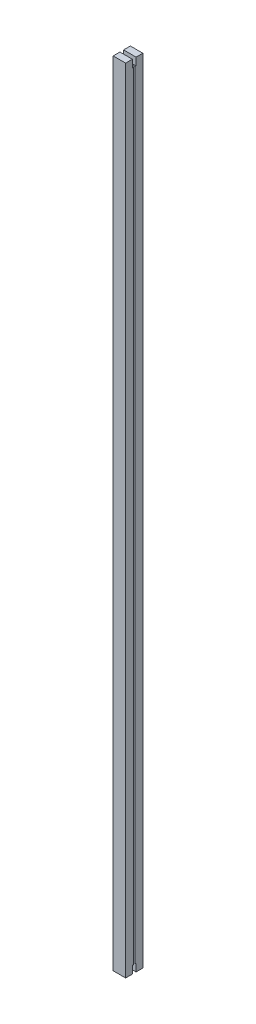
ISO-10303-21;
HEADER;
FILE_DESCRIPTION(('STEP AP214'),'2;1');
FILE_NAME('part.step','',(''),(''),'','','');
FILE_SCHEMA(('AUTOMOTIVE_DESIGN { 1 0 10303 214 1 1 1 1 }'));
ENDSEC;
DATA;
#1=APPLICATION_CONTEXT('core data for automotive mechanical design processes');
#2=APPLICATION_PROTOCOL_DEFINITION('international standard','automotive_design',2000,#1);
#3=PRODUCT_CONTEXT('',#1,'mechanical');
#4=PRODUCT('Part','Part','',(#3));
#5=PRODUCT_RELATED_PRODUCT_CATEGORY('part','',(#4));
#6=PRODUCT_DEFINITION_FORMATION('','',#4);
#7=PRODUCT_DEFINITION_CONTEXT('part definition',#1,'design');
#8=PRODUCT_DEFINITION('design','',#6,#7);
#9=PRODUCT_DEFINITION_SHAPE('','',#8);
#10=(LENGTH_UNIT() NAMED_UNIT(*) SI_UNIT(.MILLI.,.METRE.));
#11=(NAMED_UNIT(*) PLANE_ANGLE_UNIT() SI_UNIT($,.RADIAN.));
#12=(NAMED_UNIT(*) SI_UNIT($,.STERADIAN.) SOLID_ANGLE_UNIT());
#13=UNCERTAINTY_MEASURE_WITH_UNIT(LENGTH_MEASURE(1.E-05),#10,'distance_accuracy_value','');
#14=(GEOMETRIC_REPRESENTATION_CONTEXT(3) GLOBAL_UNCERTAINTY_ASSIGNED_CONTEXT((#13)) GLOBAL_UNIT_ASSIGNED_CONTEXT((#10,
#11,#12)) REPRESENTATION_CONTEXT('',''));
#15=CARTESIAN_POINT('',(0.,0.,0.));
#16=DIRECTION('',(0.,0.,1.));
#17=DIRECTION('',(1.,0.,0.));
#18=AXIS2_PLACEMENT_3D('',#15,#16,#17);
#19=CARTESIAN_POINT('',(0.,1383.55,0.));
#20=DIRECTION('',(0.,1.,0.));
#21=DIRECTION('',(0.,0.,1.));
#22=AXIS2_PLACEMENT_3D('',#19,#20,#21);
#23=PLANE('',#22);
#24=DIRECTION('',(-1.,0.,0.));
#25=VECTOR('',#24,1.);
#26=CARTESIAN_POINT('',(10.,1383.55,3.19875941757056));
#27=LINE('',#26,#25);
#28=CARTESIAN_POINT('',(10.,1383.55,3.19875941757056));
#29=VERTEX_POINT('',#28);
#30=CARTESIAN_POINT('',(-11.7648656271416,1383.55,3.19875941757056));
#31=VERTEX_POINT('',#30);
#32=EDGE_CURVE('E180',#29,#31,#27,.T.);
#33=ORIENTED_EDGE('',*,*,#32,.T.);
#34=DIRECTION('',(0.,0.,1.));
#35=VECTOR('',#34,1.);
#36=CARTESIAN_POINT('',(-11.7648656271416,1383.55,-15.));
#37=LINE('',#36,#35);
#38=CARTESIAN_POINT('',(-11.7648656271416,1383.55,15.));
#39=VERTEX_POINT('',#38);
#40=EDGE_CURVE('E232',#31,#39,#37,.T.);
#41=ORIENTED_EDGE('',*,*,#40,.T.);
#42=DIRECTION('',(1.,0.,0.));
#43=VECTOR('',#42,1.);
#44=CARTESIAN_POINT('',(-11.7648656271416,1383.55,15.));
#45=LINE('',#44,#43);
#46=CARTESIAN_POINT('',(10.,1383.55,15.));
#47=VERTEX_POINT('',#46);
#48=EDGE_CURVE('E231',#39,#47,#45,.T.);
#49=ORIENTED_EDGE('',*,*,#48,.T.);
#50=DIRECTION('',(0.,0.,-1.));
#51=VECTOR('',#50,1.);
#52=CARTESIAN_POINT('',(10.,1383.55,15.));
#53=LINE('',#52,#51);
#54=EDGE_CURVE('E234',#47,#29,#53,.T.);
#55=ORIENTED_EDGE('',*,*,#54,.T.);
#56=EDGE_LOOP('',(#33,#41,#49,#55));
#57=FACE_BOUND('',#56,.T.);
#58=ADVANCED_FACE('F33',(#57),#23,.T.);
#59=CARTESIAN_POINT('',(0.,0.,0.));
#60=DIRECTION('',(0.,1.,0.));
#61=DIRECTION('',(0.,0.,1.));
#62=AXIS2_PLACEMENT_3D('',#59,#60,#61);
#63=PLANE('',#62);
#64=DIRECTION('',(0.,0.,-1.));
#65=VECTOR('',#64,1.);
#66=CARTESIAN_POINT('',(10.,0.,-15.));
#67=LINE('',#66,#65);
#68=CARTESIAN_POINT('',(10.,0.,-3.19875941757056));
#69=VERTEX_POINT('',#68);
#70=CARTESIAN_POINT('',(10.,0.,-15.));
#71=VERTEX_POINT('',#70);
#72=EDGE_CURVE('E248',#69,#71,#67,.T.);
#73=ORIENTED_EDGE('',*,*,#72,.F.);
#74=DIRECTION('',(-1.,0.,0.));
#75=VECTOR('',#74,1.);
#76=CARTESIAN_POINT('',(10.,0.,-3.19875941757056));
#77=LINE('',#76,#75);
#78=CARTESIAN_POINT('',(-11.7648656271416,0.,-3.19875941757056));
#79=VERTEX_POINT('',#78);
#80=EDGE_CURVE('E182',#69,#79,#77,.T.);
#81=ORIENTED_EDGE('',*,*,#80,.T.);
#82=DIRECTION('',(0.,0.,1.));
#83=VECTOR('',#82,1.);
#84=CARTESIAN_POINT('',(-11.7648656271416,0.,-15.));
#85=LINE('',#84,#83);
#86=CARTESIAN_POINT('',(-11.7648656271416,0.,-15.));
#87=VERTEX_POINT('',#86);
#88=EDGE_CURVE('E242',#87,#79,#85,.T.);
#89=ORIENTED_EDGE('',*,*,#88,.F.);
#90=DIRECTION('',(-1.,0.,0.));
#91=VECTOR('',#90,1.);
#92=CARTESIAN_POINT('',(-11.7648656271416,0.,-15.));
#93=LINE('',#92,#91);
#94=EDGE_CURVE('E250',#71,#87,#93,.T.);
#95=ORIENTED_EDGE('',*,*,#94,.F.);
#96=EDGE_LOOP('',(#73,#81,#89,#95));
#97=FACE_BOUND('',#96,.T.);
#98=ADVANCED_FACE('F311',(#97),#63,.F.);
#99=CARTESIAN_POINT('',(-11.7648656271416,1383.55,-15.));
#100=DIRECTION('',(1.,0.,0.));
#101=DIRECTION('',(0.,0.,-1.));
#102=AXIS2_PLACEMENT_3D('',#99,#100,#101);
#103=PLANE('',#102);
#104=ORIENTED_EDGE('',*,*,#88,.T.);
#105=DIRECTION('',(0.,-1.,0.));
#106=VECTOR('',#105,1.);
#107=CARTESIAN_POINT('',(-11.7648656271416,0.,-3.19875941757056));
#108=LINE('',#107,#106);
#109=CARTESIAN_POINT('',(-11.7648656271416,13.2878235912347,-3.19875941757056));
#110=VERTEX_POINT('',#109);
#111=EDGE_CURVE('E171',#110,#79,#108,.T.);
#112=ORIENTED_EDGE('',*,*,#111,.F.);
#113=DIRECTION('',(0.,0.,-1.));
#114=VECTOR('',#113,1.);
#115=CARTESIAN_POINT('',(-11.7648656271416,13.2878235912347,-3.19875941757056));
#116=LINE('',#115,#114);
#117=CARTESIAN_POINT('',(-11.7648656271416,13.2878235912347,3.19875941757056));
#118=VERTEX_POINT('',#117);
#119=EDGE_CURVE('E174',#118,#110,#116,.T.);
#120=ORIENTED_EDGE('',*,*,#119,.F.);
#121=DIRECTION('',(0.,1.,0.));
#122=VECTOR('',#121,1.);
#123=CARTESIAN_POINT('',(-11.7648656271416,0.,3.19875941757056));
#124=LINE('',#123,#122);
#125=CARTESIAN_POINT('',(-11.7648656271416,0.,3.19875941757056));
#126=VERTEX_POINT('',#125);
#127=EDGE_CURVE('E148',#126,#118,#124,.T.);
#128=ORIENTED_EDGE('',*,*,#127,.F.);
#129=CARTESIAN_POINT('',(-11.7648656271416,0.,15.));
#130=VERTEX_POINT('',#129);
#131=EDGE_CURVE('E227',#126,#130,#85,.T.);
#132=ORIENTED_EDGE('',*,*,#131,.T.);
#133=DIRECTION('',(0.,-1.,0.));
#134=VECTOR('',#133,1.);
#135=CARTESIAN_POINT('',(-11.7648656271416,1383.55,15.));
#136=LINE('',#135,#134);
#137=EDGE_CURVE('E11',#39,#130,#136,.T.);
#138=ORIENTED_EDGE('',*,*,#137,.F.);
#139=ORIENTED_EDGE('',*,*,#40,.F.);
#140=DIRECTION('',(0.,1.,0.));
#141=VECTOR('',#140,1.);
#142=CARTESIAN_POINT('',(-11.7648656271416,1383.55,3.19875941757056));
#143=LINE('',#142,#141);
#144=CARTESIAN_POINT('',(-11.7648656271416,1370.26217640877,3.19875941757056));
#145=VERTEX_POINT('',#144);
#146=EDGE_CURVE('E190',#145,#31,#143,.T.);
#147=ORIENTED_EDGE('',*,*,#146,.F.);
#148=DIRECTION('',(0.,0.,1.));
#149=VECTOR('',#148,1.);
#150=CARTESIAN_POINT('',(-11.7648656271416,1370.26217640877,-3.19875941757056));
#151=LINE('',#150,#149);
#152=CARTESIAN_POINT('',(-11.7648656271416,1370.26217640877,-3.19875941757056));
#153=VERTEX_POINT('',#152);
#154=EDGE_CURVE('E201',#153,#145,#151,.T.);
#155=ORIENTED_EDGE('',*,*,#154,.F.);
#156=DIRECTION('',(0.,-1.,0.));
#157=VECTOR('',#156,1.);
#158=CARTESIAN_POINT('',(-11.7648656271416,1383.55,-3.19875941757056));
#159=LINE('',#158,#157);
#160=CARTESIAN_POINT('',(-11.7648656271416,1383.55,-3.19875941757056));
#161=VERTEX_POINT('',#160);
#162=EDGE_CURVE('E198',#161,#153,#159,.T.);
#163=ORIENTED_EDGE('',*,*,#162,.F.);
#164=CARTESIAN_POINT('',(-11.7648656271416,1383.55,-15.));
#165=VERTEX_POINT('',#164);
#166=EDGE_CURVE('E228',#165,#161,#37,.T.);
#167=ORIENTED_EDGE('',*,*,#166,.F.);
#168=DIRECTION('',(0.,-1.,0.));
#169=VECTOR('',#168,1.);
#170=CARTESIAN_POINT('',(-11.7648656271416,1383.55,-15.));
#171=LINE('',#170,#169);
#172=EDGE_CURVE('E241',#165,#87,#171,.T.);
#173=ORIENTED_EDGE('',*,*,#172,.T.);
#174=EDGE_LOOP('',(#104,#112,#120,#128,#132,#138,#139,#147,#155,#163,#167,#173));
#175=FACE_BOUND('',#174,.T.);
#176=ADVANCED_FACE('F35',(#175),#103,.F.);
#177=CARTESIAN_POINT('',(-11.7648656271416,1383.55,15.));
#178=DIRECTION('',(0.,0.,-1.));
#179=DIRECTION('',(-1.,0.,0.));
#180=AXIS2_PLACEMENT_3D('',#177,#178,#179);
#181=PLANE('',#180);
#182=DIRECTION('',(1.,0.,0.));
#183=VECTOR('',#182,1.);
#184=CARTESIAN_POINT('',(-11.7648656271416,0.,15.));
#185=LINE('',#184,#183);
#186=CARTESIAN_POINT('',(10.,0.,15.));
#187=VERTEX_POINT('',#186);
#188=EDGE_CURVE('E245',#130,#187,#185,.T.);
#189=ORIENTED_EDGE('',*,*,#188,.T.);
#190=DIRECTION('',(0.,-1.,0.));
#191=VECTOR('',#190,1.);
#192=CARTESIAN_POINT('',(10.,1383.55,15.));
#193=LINE('',#192,#191);
#194=EDGE_CURVE('E41',#47,#187,#193,.T.);
#195=ORIENTED_EDGE('',*,*,#194,.F.);
#196=ORIENTED_EDGE('',*,*,#48,.F.);
#197=ORIENTED_EDGE('',*,*,#137,.T.);
#198=EDGE_LOOP('',(#189,#195,#196,#197));
#199=FACE_BOUND('',#198,.T.);
#200=ADVANCED_FACE('F304',(#199),#181,.F.);
#201=CARTESIAN_POINT('',(10.,1383.55,15.));
#202=DIRECTION('',(-1.,0.,0.));
#203=DIRECTION('',(0.,0.,1.));
#204=AXIS2_PLACEMENT_3D('',#201,#202,#203);
#205=PLANE('',#204);
#206=DIRECTION('',(0.,1.,0.));
#207=VECTOR('',#206,1.);
#208=CARTESIAN_POINT('',(10.,0.,3.19875941757056));
#209=LINE('',#208,#207);
#210=CARTESIAN_POINT('',(10.,0.,3.19875941757056));
#211=VERTEX_POINT('',#210);
#212=CARTESIAN_POINT('',(10.,13.2878235912347,3.19875941757056));
#213=VERTEX_POINT('',#212);
#214=EDGE_CURVE('E56',#211,#213,#209,.T.);
#215=ORIENTED_EDGE('',*,*,#214,.T.);
#216=DIRECTION('',(0.,0.,-1.));
#217=VECTOR('',#216,1.);
#218=CARTESIAN_POINT('',(10.,13.2878235912347,-3.19875941757056));
#219=LINE('',#218,#217);
#220=CARTESIAN_POINT('',(10.,13.2878235912347,1.25));
#221=VERTEX_POINT('',#220);
#222=EDGE_CURVE('E156',#213,#221,#219,.T.);
#223=ORIENTED_EDGE('',*,*,#222,.T.);
#224=DIRECTION('',(0.,-1.,0.));
#225=VECTOR('',#224,1.);
#226=CARTESIAN_POINT('',(10.,1383.55,1.25));
#227=LINE('',#226,#225);
#228=CARTESIAN_POINT('',(10.,1370.26217640877,1.25));
#229=VERTEX_POINT('',#228);
#230=EDGE_CURVE('E266',#229,#221,#227,.T.);
#231=ORIENTED_EDGE('',*,*,#230,.F.);
#232=DIRECTION('',(0.,0.,1.));
#233=VECTOR('',#232,1.);
#234=CARTESIAN_POINT('',(10.,1370.26217640877,-3.19875941757056));
#235=LINE('',#234,#233);
#236=CARTESIAN_POINT('',(10.,1370.26217640877,3.19875941757056));
#237=VERTEX_POINT('',#236);
#238=EDGE_CURVE('E189',#229,#237,#235,.T.);
#239=ORIENTED_EDGE('',*,*,#238,.T.);
#240=DIRECTION('',(0.,1.,0.));
#241=VECTOR('',#240,1.);
#242=CARTESIAN_POINT('',(10.,1383.55,3.19875941757056));
#243=LINE('',#242,#241);
#244=EDGE_CURVE('E194',#237,#29,#243,.T.);
#245=ORIENTED_EDGE('',*,*,#244,.T.);
#246=ORIENTED_EDGE('',*,*,#54,.F.);
#247=ORIENTED_EDGE('',*,*,#194,.T.);
#248=DIRECTION('',(0.,0.,-1.));
#249=VECTOR('',#248,1.);
#250=CARTESIAN_POINT('',(10.,0.,15.));
#251=LINE('',#250,#249);
#252=EDGE_CURVE('E170',#187,#211,#251,.T.);
#253=ORIENTED_EDGE('',*,*,#252,.T.);
#254=EDGE_LOOP('',(#215,#223,#231,#239,#245,#246,#247,#253));
#255=FACE_BOUND('',#254,.T.);
#256=ADVANCED_FACE('F167',(#255),#205,.F.);
#257=CARTESIAN_POINT('',(10.,1383.55,1.25));
#258=DIRECTION('',(0.,0.,1.));
#259=DIRECTION('',(1.,0.,0.));
#260=AXIS2_PLACEMENT_3D('',#257,#258,#259);
#261=PLANE('',#260);
#262=ORIENTED_EDGE('',*,*,#230,.T.);
#263=DIRECTION('',(-1.,0.,0.));
#264=VECTOR('',#263,1.);
#265=CARTESIAN_POINT('',(10.,13.2878235912346,1.25));
#266=LINE('',#265,#264);
#267=CARTESIAN_POINT('',(6.,13.2878235912346,1.25));
#268=VERTEX_POINT('',#267);
#269=EDGE_CURVE('E159',#221,#268,#266,.T.);
#270=ORIENTED_EDGE('',*,*,#269,.T.);
#271=DIRECTION('',(0.,-1.,0.));
#272=VECTOR('',#271,1.);
#273=CARTESIAN_POINT('',(6.,1383.55,1.25));
#274=LINE('',#273,#272);
#275=CARTESIAN_POINT('',(6.,1370.26217640877,1.25));
#276=VERTEX_POINT('',#275);
#277=EDGE_CURVE('E263',#276,#268,#274,.T.);
#278=ORIENTED_EDGE('',*,*,#277,.F.);
#279=DIRECTION('',(1.,0.,0.));
#280=VECTOR('',#279,1.);
#281=CARTESIAN_POINT('',(10.,1370.26217640877,1.25));
#282=LINE('',#281,#280);
#283=EDGE_CURVE('E217',#276,#229,#282,.T.);
#284=ORIENTED_EDGE('',*,*,#283,.T.);
#285=EDGE_LOOP('',(#262,#270,#278,#284));
#286=FACE_BOUND('',#285,.T.);
#287=ADVANCED_FACE('F293',(#286),#261,.F.);
#288=CARTESIAN_POINT('',(6.,1383.55,-1.25));
#289=DIRECTION('',(-1.,0.,0.));
#290=DIRECTION('',(0.,0.,1.));
#291=AXIS2_PLACEMENT_3D('',#288,#289,#290);
#292=PLANE('',#291);
#293=ORIENTED_EDGE('',*,*,#277,.T.);
#294=DIRECTION('',(0.,0.,-1.));
#295=VECTOR('',#294,1.);
#296=CARTESIAN_POINT('',(6.,13.2878235912346,-1.25));
#297=LINE('',#296,#295);
#298=CARTESIAN_POINT('',(6.,13.2878235912346,-1.25));
#299=VERTEX_POINT('',#298);
#300=EDGE_CURVE('E223',#268,#299,#297,.T.);
#301=ORIENTED_EDGE('',*,*,#300,.T.);
#302=DIRECTION('',(0.,-1.,0.));
#303=VECTOR('',#302,1.);
#304=CARTESIAN_POINT('',(6.,1383.55,-1.25));
#305=LINE('',#304,#303);
#306=CARTESIAN_POINT('',(6.,1370.26217640877,-1.25));
#307=VERTEX_POINT('',#306);
#308=EDGE_CURVE('E260',#307,#299,#305,.T.);
#309=ORIENTED_EDGE('',*,*,#308,.F.);
#310=DIRECTION('',(0.,0.,1.));
#311=VECTOR('',#310,1.);
#312=CARTESIAN_POINT('',(6.,1370.26217640877,-1.25));
#313=LINE('',#312,#311);
#314=EDGE_CURVE('E214',#307,#276,#313,.T.);
#315=ORIENTED_EDGE('',*,*,#314,.T.);
#316=EDGE_LOOP('',(#293,#301,#309,#315));
#317=FACE_BOUND('',#316,.T.);
#318=ADVANCED_FACE('F290',(#317),#292,.F.);
#319=CARTESIAN_POINT('',(10.,1383.55,-1.25));
#320=DIRECTION('',(0.,0.,-1.));
#321=DIRECTION('',(-1.,0.,0.));
#322=AXIS2_PLACEMENT_3D('',#319,#320,#321);
#323=PLANE('',#322);
#324=ORIENTED_EDGE('',*,*,#308,.T.);
#325=DIRECTION('',(1.,0.,0.));
#326=VECTOR('',#325,1.);
#327=CARTESIAN_POINT('',(10.,13.2878235912346,-1.25));
#328=LINE('',#327,#326);
#329=CARTESIAN_POINT('',(10.,13.2878235912347,-1.25));
#330=VERTEX_POINT('',#329);
#331=EDGE_CURVE('E220',#299,#330,#328,.T.);
#332=ORIENTED_EDGE('',*,*,#331,.T.);
#333=DIRECTION('',(0.,-1.,0.));
#334=VECTOR('',#333,1.);
#335=CARTESIAN_POINT('',(10.,1383.55,-1.25));
#336=LINE('',#335,#334);
#337=CARTESIAN_POINT('',(10.,1370.26217640877,-1.25));
#338=VERTEX_POINT('',#337);
#339=EDGE_CURVE('E257',#338,#330,#336,.T.);
#340=ORIENTED_EDGE('',*,*,#339,.F.);
#341=DIRECTION('',(-1.,0.,0.));
#342=VECTOR('',#341,1.);
#343=CARTESIAN_POINT('',(10.,1370.26217640877,-1.25));
#344=LINE('',#343,#342);
#345=EDGE_CURVE('E185',#338,#307,#344,.T.);
#346=ORIENTED_EDGE('',*,*,#345,.T.);
#347=EDGE_LOOP('',(#324,#332,#340,#346));
#348=FACE_BOUND('',#347,.T.);
#349=ADVANCED_FACE('F287',(#348),#323,.F.);
#350=CARTESIAN_POINT('',(10.,1383.55,-15.));
#351=DIRECTION('',(-1.,0.,0.));
#352=DIRECTION('',(0.,0.,1.));
#353=AXIS2_PLACEMENT_3D('',#350,#351,#352);
#354=PLANE('',#353);
#355=CARTESIAN_POINT('',(10.,13.2878235912347,-3.19875941757056));
#356=VERTEX_POINT('',#355);
#357=EDGE_CURVE('E164',#330,#356,#219,.T.);
#358=ORIENTED_EDGE('',*,*,#357,.T.);
#359=DIRECTION('',(0.,-1.,0.));
#360=VECTOR('',#359,1.);
#361=CARTESIAN_POINT('',(10.,0.,-3.19875941757056));
#362=LINE('',#361,#360);
#363=EDGE_CURVE('E163',#356,#69,#362,.T.);
#364=ORIENTED_EDGE('',*,*,#363,.T.);
#365=ORIENTED_EDGE('',*,*,#72,.T.);
#366=DIRECTION('',(0.,-1.,0.));
#367=VECTOR('',#366,1.);
#368=CARTESIAN_POINT('',(10.,1383.55,-15.));
#369=LINE('',#368,#367);
#370=CARTESIAN_POINT('',(10.,1383.55,-15.));
#371=VERTEX_POINT('',#370);
#372=EDGE_CURVE('E254',#371,#71,#369,.T.);
#373=ORIENTED_EDGE('',*,*,#372,.F.);
#374=DIRECTION('',(0.,0.,-1.));
#375=VECTOR('',#374,1.);
#376=CARTESIAN_POINT('',(10.,1383.55,-15.));
#377=LINE('',#376,#375);
#378=CARTESIAN_POINT('',(10.,1383.55,-3.19875941757056));
#379=VERTEX_POINT('',#378);
#380=EDGE_CURVE('E237',#379,#371,#377,.T.);
#381=ORIENTED_EDGE('',*,*,#380,.F.);
#382=DIRECTION('',(0.,-1.,0.));
#383=VECTOR('',#382,1.);
#384=CARTESIAN_POINT('',(10.,1383.55,-3.19875941757056));
#385=LINE('',#384,#383);
#386=CARTESIAN_POINT('',(10.,1370.26217640877,-3.19875941757056));
#387=VERTEX_POINT('',#386);
#388=EDGE_CURVE('E48',#379,#387,#385,.T.);
#389=ORIENTED_EDGE('',*,*,#388,.T.);
#390=EDGE_CURVE('E191',#387,#338,#235,.T.);
#391=ORIENTED_EDGE('',*,*,#390,.T.);
#392=ORIENTED_EDGE('',*,*,#339,.T.);
#393=EDGE_LOOP('',(#358,#364,#365,#373,#381,#389,#391,#392));
#394=FACE_BOUND('',#393,.T.);
#395=ADVANCED_FACE('F283',(#394),#354,.F.);
#396=CARTESIAN_POINT('',(-11.7648656271416,1383.55,-15.));
#397=DIRECTION('',(0.,0.,1.));
#398=DIRECTION('',(1.,0.,0.));
#399=AXIS2_PLACEMENT_3D('',#396,#397,#398);
#400=PLANE('',#399);
#401=ORIENTED_EDGE('',*,*,#94,.T.);
#402=ORIENTED_EDGE('',*,*,#172,.F.);
#403=DIRECTION('',(-1.,0.,0.));
#404=VECTOR('',#403,1.);
#405=CARTESIAN_POINT('',(-11.7648656271416,1383.55,-15.));
#406=LINE('',#405,#404);
#407=EDGE_CURVE('E239',#371,#165,#406,.T.);
#408=ORIENTED_EDGE('',*,*,#407,.F.);
#409=ORIENTED_EDGE('',*,*,#372,.T.);
#410=EDGE_LOOP('',(#401,#402,#408,#409));
#411=FACE_BOUND('',#410,.T.);
#412=ADVANCED_FACE('F322',(#411),#400,.F.);
#413=DIRECTION('',(-1.,0.,0.));
#414=VECTOR('',#413,1.);
#415=CARTESIAN_POINT('',(10.,1383.55,-3.19875941757056));
#416=LINE('',#415,#414);
#417=EDGE_CURVE('E197',#379,#161,#416,.T.);
#418=ORIENTED_EDGE('',*,*,#417,.F.);
#419=ORIENTED_EDGE('',*,*,#380,.T.);
#420=ORIENTED_EDGE('',*,*,#407,.T.);
#421=ORIENTED_EDGE('',*,*,#166,.T.);
#422=EDGE_LOOP('',(#418,#419,#420,#421));
#423=FACE_BOUND('',#422,.T.);
#424=ADVANCED_FACE('F314',(#423),#23,.T.);
#425=ORIENTED_EDGE('',*,*,#131,.F.);
#426=DIRECTION('',(-1.,0.,0.));
#427=VECTOR('',#426,1.);
#428=CARTESIAN_POINT('',(10.,0.,3.19875941757056));
#429=LINE('',#428,#427);
#430=EDGE_CURVE('E153',#211,#126,#429,.T.);
#431=ORIENTED_EDGE('',*,*,#430,.F.);
#432=ORIENTED_EDGE('',*,*,#252,.F.);
#433=ORIENTED_EDGE('',*,*,#188,.F.);
#434=EDGE_LOOP('',(#425,#431,#432,#433));
#435=FACE_BOUND('',#434,.T.);
#436=ADVANCED_FACE('F274',(#435),#63,.F.);
#437=CARTESIAN_POINT('',(10.,13.2878235912347,-3.19875941757056));
#438=DIRECTION('',(0.,1.,0.));
#439=DIRECTION('',(0.,0.,1.));
#440=AXIS2_PLACEMENT_3D('',#437,#438,#439);
#441=PLANE('',#440);
#442=ORIENTED_EDGE('',*,*,#222,.F.);
#443=DIRECTION('',(-1.,0.,0.));
#444=VECTOR('',#443,1.);
#445=CARTESIAN_POINT('',(10.,13.2878235912347,3.19875941757056));
#446=LINE('',#445,#444);
#447=EDGE_CURVE('E144',#213,#118,#446,.T.);
#448=ORIENTED_EDGE('',*,*,#447,.T.);
#449=ORIENTED_EDGE('',*,*,#119,.T.);
#450=DIRECTION('',(-1.,0.,0.));
#451=VECTOR('',#450,1.);
#452=CARTESIAN_POINT('',(10.,13.2878235912347,-3.19875941757056));
#453=LINE('',#452,#451);
#454=EDGE_CURVE('E152',#356,#110,#453,.T.);
#455=ORIENTED_EDGE('',*,*,#454,.F.);
#456=ORIENTED_EDGE('',*,*,#357,.F.);
#457=ORIENTED_EDGE('',*,*,#331,.F.);
#458=ORIENTED_EDGE('',*,*,#300,.F.);
#459=ORIENTED_EDGE('',*,*,#269,.F.);
#460=EDGE_LOOP('',(#442,#448,#449,#455,#456,#457,#458,#459));
#461=FACE_BOUND('',#460,.T.);
#462=ADVANCED_FACE('F157',(#461),#441,.F.);
#463=CARTESIAN_POINT('',(10.,0.,-3.19875941757056));
#464=DIRECTION('',(0.,0.,-1.));
#465=DIRECTION('',(-1.,0.,0.));
#466=AXIS2_PLACEMENT_3D('',#463,#464,#465);
#467=PLANE('',#466);
#468=ORIENTED_EDGE('',*,*,#111,.T.);
#469=ORIENTED_EDGE('',*,*,#80,.F.);
#470=ORIENTED_EDGE('',*,*,#363,.F.);
#471=ORIENTED_EDGE('',*,*,#454,.T.);
#472=EDGE_LOOP('',(#468,#469,#470,#471));
#473=FACE_BOUND('',#472,.T.);
#474=ADVANCED_FACE('F280',(#473),#467,.F.);
#475=CARTESIAN_POINT('',(10.,0.,3.19875941757056));
#476=DIRECTION('',(0.,0.,1.));
#477=DIRECTION('',(1.,0.,0.));
#478=AXIS2_PLACEMENT_3D('',#475,#476,#477);
#479=PLANE('',#478);
#480=ORIENTED_EDGE('',*,*,#127,.T.);
#481=ORIENTED_EDGE('',*,*,#447,.F.);
#482=ORIENTED_EDGE('',*,*,#214,.F.);
#483=ORIENTED_EDGE('',*,*,#430,.T.);
#484=EDGE_LOOP('',(#480,#481,#482,#483));
#485=FACE_BOUND('',#484,.T.);
#486=ADVANCED_FACE('F146',(#485),#479,.F.);
#487=CARTESIAN_POINT('',(10.,1370.26217640877,-3.19875941757056));
#488=DIRECTION('',(0.,-1.,0.));
#489=DIRECTION('',(0.,0.,-1.));
#490=AXIS2_PLACEMENT_3D('',#487,#488,#489);
#491=PLANE('',#490);
#492=ORIENTED_EDGE('',*,*,#314,.F.);
#493=ORIENTED_EDGE('',*,*,#345,.F.);
#494=ORIENTED_EDGE('',*,*,#390,.F.);
#495=DIRECTION('',(-1.,0.,0.));
#496=VECTOR('',#495,1.);
#497=CARTESIAN_POINT('',(10.,1370.26217640877,-3.19875941757056));
#498=LINE('',#497,#496);
#499=EDGE_CURVE('E209',#387,#153,#498,.T.);
#500=ORIENTED_EDGE('',*,*,#499,.T.);
#501=ORIENTED_EDGE('',*,*,#154,.T.);
#502=DIRECTION('',(-1.,0.,0.));
#503=VECTOR('',#502,1.);
#504=CARTESIAN_POINT('',(10.,1370.26217640877,3.19875941757056));
#505=LINE('',#504,#503);
#506=EDGE_CURVE('E207',#237,#145,#505,.T.);
#507=ORIENTED_EDGE('',*,*,#506,.F.);
#508=ORIENTED_EDGE('',*,*,#238,.F.);
#509=ORIENTED_EDGE('',*,*,#283,.F.);
#510=EDGE_LOOP('',(#492,#493,#494,#500,#501,#507,#508,#509));
#511=FACE_BOUND('',#510,.T.);
#512=ADVANCED_FACE('F297',(#511),#491,.F.);
#513=CARTESIAN_POINT('',(10.,1383.55,3.19875941757056));
#514=DIRECTION('',(0.,0.,1.));
#515=DIRECTION('',(1.,0.,0.));
#516=AXIS2_PLACEMENT_3D('',#513,#514,#515);
#517=PLANE('',#516);
#518=ORIENTED_EDGE('',*,*,#146,.T.);
#519=ORIENTED_EDGE('',*,*,#32,.F.);
#520=ORIENTED_EDGE('',*,*,#244,.F.);
#521=ORIENTED_EDGE('',*,*,#506,.T.);
#522=EDGE_LOOP('',(#518,#519,#520,#521));
#523=FACE_BOUND('',#522,.T.);
#524=ADVANCED_FACE('F301',(#523),#517,.F.);
#525=CARTESIAN_POINT('',(10.,1383.55,-3.19875941757056));
#526=DIRECTION('',(0.,0.,-1.));
#527=DIRECTION('',(-1.,0.,0.));
#528=AXIS2_PLACEMENT_3D('',#525,#526,#527);
#529=PLANE('',#528);
#530=ORIENTED_EDGE('',*,*,#162,.T.);
#531=ORIENTED_EDGE('',*,*,#499,.F.);
#532=ORIENTED_EDGE('',*,*,#388,.F.);
#533=ORIENTED_EDGE('',*,*,#417,.T.);
#534=EDGE_LOOP('',(#530,#531,#532,#533));
#535=FACE_BOUND('',#534,.T.);
#536=ADVANCED_FACE('F338',(#535),#529,.F.);
#537=CLOSED_SHELL('',(#58,#98,#176,#200,#256,#287,#318,#349,#395,#412,#424,#436,#462,#474,#486,
#512,#524,#536));
#538=MANIFOLD_SOLID_BREP('B2',#537);
#539=ADVANCED_BREP_SHAPE_REPRESENTATION('',(#18,#538),#14);
#540=SHAPE_DEFINITION_REPRESENTATION(#9,#539);
ENDSEC;
END-ISO-10303-21;
